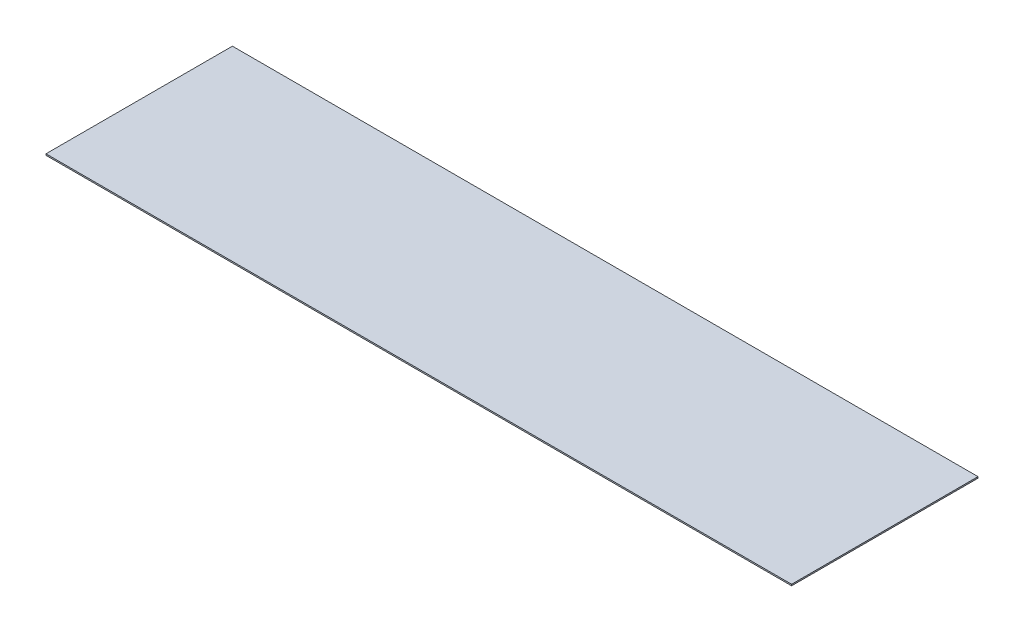
ISO-10303-21;
HEADER;
FILE_DESCRIPTION(('STEP AP214'),'2;1');
FILE_NAME('part.step','',(''),(''),'','','');
FILE_SCHEMA(('AUTOMOTIVE_DESIGN { 1 0 10303 214 1 1 1 1 }'));
ENDSEC;
DATA;
#1=APPLICATION_CONTEXT('core data for automotive mechanical design processes');
#2=APPLICATION_PROTOCOL_DEFINITION('international standard','automotive_design',2000,#1);
#3=PRODUCT_CONTEXT('',#1,'mechanical');
#4=PRODUCT('Part','Part','',(#3));
#5=PRODUCT_RELATED_PRODUCT_CATEGORY('part','',(#4));
#6=PRODUCT_DEFINITION_FORMATION('','',#4);
#7=PRODUCT_DEFINITION_CONTEXT('part definition',#1,'design');
#8=PRODUCT_DEFINITION('design','',#6,#7);
#9=PRODUCT_DEFINITION_SHAPE('','',#8);
#10=(LENGTH_UNIT() NAMED_UNIT(*) SI_UNIT(.MILLI.,.METRE.));
#11=(NAMED_UNIT(*) PLANE_ANGLE_UNIT() SI_UNIT($,.RADIAN.));
#12=(NAMED_UNIT(*) SI_UNIT($,.STERADIAN.) SOLID_ANGLE_UNIT());
#13=UNCERTAINTY_MEASURE_WITH_UNIT(LENGTH_MEASURE(1.E-05),#10,'distance_accuracy_value','');
#14=(GEOMETRIC_REPRESENTATION_CONTEXT(3) GLOBAL_UNCERTAINTY_ASSIGNED_CONTEXT((#13)) GLOBAL_UNIT_ASSIGNED_CONTEXT((#10,
#11,#12)) REPRESENTATION_CONTEXT('',''));
#15=CARTESIAN_POINT('',(0.,0.,0.));
#16=DIRECTION('',(0.,0.,1.));
#17=DIRECTION('',(1.,0.,0.));
#18=AXIS2_PLACEMENT_3D('',#15,#16,#17);
#19=CARTESIAN_POINT('',(-40.,0.15,10.));
#20=DIRECTION('',(1.,0.,0.));
#21=DIRECTION('',(0.,0.,-1.));
#22=AXIS2_PLACEMENT_3D('',#19,#20,#21);
#23=PLANE('',#22);
#24=DIRECTION('',(0.,0.,1.));
#25=VECTOR('',#24,1.);
#26=CARTESIAN_POINT('',(-40.,0.,10.));
#27=LINE('',#26,#25);
#28=CARTESIAN_POINT('',(-40.,0.,-10.));
#29=VERTEX_POINT('',#28);
#30=CARTESIAN_POINT('',(-40.,0.,10.));
#31=VERTEX_POINT('',#30);
#32=EDGE_CURVE('E96',#29,#31,#27,.T.);
#33=ORIENTED_EDGE('',*,*,#32,.T.);
#34=DIRECTION('',(0.,-1.,0.));
#35=VECTOR('',#34,1.);
#36=CARTESIAN_POINT('',(-40.,0.15,10.));
#37=LINE('',#36,#35);
#38=CARTESIAN_POINT('',(-40.,0.15,10.));
#39=VERTEX_POINT('',#38);
#40=EDGE_CURVE('E11',#39,#31,#37,.T.);
#41=ORIENTED_EDGE('',*,*,#40,.F.);
#42=DIRECTION('',(0.,0.,1.));
#43=VECTOR('',#42,1.);
#44=CARTESIAN_POINT('',(-40.,0.15,10.));
#45=LINE('',#44,#43);
#46=CARTESIAN_POINT('',(-40.,0.15,-10.));
#47=VERTEX_POINT('',#46);
#48=EDGE_CURVE('E84',#47,#39,#45,.T.);
#49=ORIENTED_EDGE('',*,*,#48,.F.);
#50=DIRECTION('',(0.,-1.,0.));
#51=VECTOR('',#50,1.);
#52=CARTESIAN_POINT('',(-40.,0.15,-10.));
#53=LINE('',#52,#51);
#54=EDGE_CURVE('E92',#47,#29,#53,.T.);
#55=ORIENTED_EDGE('',*,*,#54,.T.);
#56=EDGE_LOOP('',(#33,#41,#49,#55));
#57=FACE_BOUND('',#56,.T.);
#58=ADVANCED_FACE('F33',(#57),#23,.F.);
#59=CARTESIAN_POINT('',(40.,0.15,10.));
#60=DIRECTION('',(0.,0.,-1.));
#61=DIRECTION('',(-1.,0.,0.));
#62=AXIS2_PLACEMENT_3D('',#59,#60,#61);
#63=PLANE('',#62);
#64=DIRECTION('',(1.,0.,0.));
#65=VECTOR('',#64,1.);
#66=CARTESIAN_POINT('',(40.,0.,10.));
#67=LINE('',#66,#65);
#68=CARTESIAN_POINT('',(40.,0.,10.));
#69=VERTEX_POINT('',#68);
#70=EDGE_CURVE('E88',#31,#69,#67,.T.);
#71=ORIENTED_EDGE('',*,*,#70,.T.);
#72=DIRECTION('',(0.,-1.,0.));
#73=VECTOR('',#72,1.);
#74=CARTESIAN_POINT('',(40.,0.15,10.));
#75=LINE('',#74,#73);
#76=CARTESIAN_POINT('',(40.,0.15,10.));
#77=VERTEX_POINT('',#76);
#78=EDGE_CURVE('E41',#77,#69,#75,.T.);
#79=ORIENTED_EDGE('',*,*,#78,.F.);
#80=DIRECTION('',(1.,0.,0.));
#81=VECTOR('',#80,1.);
#82=CARTESIAN_POINT('',(40.,0.15,10.));
#83=LINE('',#82,#81);
#84=EDGE_CURVE('E79',#39,#77,#83,.T.);
#85=ORIENTED_EDGE('',*,*,#84,.F.);
#86=ORIENTED_EDGE('',*,*,#40,.T.);
#87=EDGE_LOOP('',(#71,#79,#85,#86));
#88=FACE_BOUND('',#87,.T.);
#89=ADVANCED_FACE('F87',(#88),#63,.F.);
#90=CARTESIAN_POINT('',(40.,0.15,10.));
#91=DIRECTION('',(-1.,0.,0.));
#92=DIRECTION('',(0.,0.,1.));
#93=AXIS2_PLACEMENT_3D('',#90,#91,#92);
#94=PLANE('',#93);
#95=DIRECTION('',(0.,0.,-1.));
#96=VECTOR('',#95,1.);
#97=CARTESIAN_POINT('',(40.,0.,10.));
#98=LINE('',#97,#96);
#99=CARTESIAN_POINT('',(40.,0.,-10.));
#100=VERTEX_POINT('',#99);
#101=EDGE_CURVE('E66',#69,#100,#98,.T.);
#102=ORIENTED_EDGE('',*,*,#101,.T.);
#103=DIRECTION('',(0.,-1.,0.));
#104=VECTOR('',#103,1.);
#105=CARTESIAN_POINT('',(40.,0.15,-10.));
#106=LINE('',#105,#104);
#107=CARTESIAN_POINT('',(40.,0.15,-10.));
#108=VERTEX_POINT('',#107);
#109=EDGE_CURVE('E89',#108,#100,#106,.T.);
#110=ORIENTED_EDGE('',*,*,#109,.F.);
#111=DIRECTION('',(0.,0.,-1.));
#112=VECTOR('',#111,1.);
#113=CARTESIAN_POINT('',(40.,0.15,10.));
#114=LINE('',#113,#112);
#115=EDGE_CURVE('E82',#77,#108,#114,.T.);
#116=ORIENTED_EDGE('',*,*,#115,.F.);
#117=ORIENTED_EDGE('',*,*,#78,.T.);
#118=EDGE_LOOP('',(#102,#110,#116,#117));
#119=FACE_BOUND('',#118,.T.);
#120=ADVANCED_FACE('F90',(#119),#94,.F.);
#121=CARTESIAN_POINT('',(40.,0.15,-10.));
#122=DIRECTION('',(0.,0.,1.));
#123=DIRECTION('',(1.,0.,0.));
#124=AXIS2_PLACEMENT_3D('',#121,#122,#123);
#125=PLANE('',#124);
#126=DIRECTION('',(-1.,0.,0.));
#127=VECTOR('',#126,1.);
#128=CARTESIAN_POINT('',(40.,0.,-10.));
#129=LINE('',#128,#127);
#130=EDGE_CURVE('E72',#100,#29,#129,.T.);
#131=ORIENTED_EDGE('',*,*,#130,.T.);
#132=ORIENTED_EDGE('',*,*,#54,.F.);
#133=DIRECTION('',(-1.,0.,0.));
#134=VECTOR('',#133,1.);
#135=CARTESIAN_POINT('',(40.,0.15,-10.));
#136=LINE('',#135,#134);
#137=EDGE_CURVE('E49',#108,#47,#136,.T.);
#138=ORIENTED_EDGE('',*,*,#137,.F.);
#139=ORIENTED_EDGE('',*,*,#109,.T.);
#140=EDGE_LOOP('',(#131,#132,#138,#139));
#141=FACE_BOUND('',#140,.T.);
#142=ADVANCED_FACE('F103',(#141),#125,.F.);
#143=CARTESIAN_POINT('',(0.,0.15,0.));
#144=DIRECTION('',(0.,1.,0.));
#145=DIRECTION('',(0.,0.,1.));
#146=AXIS2_PLACEMENT_3D('',#143,#144,#145);
#147=PLANE('',#146);
#148=ORIENTED_EDGE('',*,*,#48,.T.);
#149=ORIENTED_EDGE('',*,*,#84,.T.);
#150=ORIENTED_EDGE('',*,*,#115,.T.);
#151=ORIENTED_EDGE('',*,*,#137,.T.);
#152=EDGE_LOOP('',(#148,#149,#150,#151));
#153=FACE_BOUND('',#152,.T.);
#154=ADVANCED_FACE('F80',(#153),#147,.T.);
#155=CARTESIAN_POINT('',(0.,0.,0.));
#156=DIRECTION('',(0.,1.,0.));
#157=DIRECTION('',(0.,0.,1.));
#158=AXIS2_PLACEMENT_3D('',#155,#156,#157);
#159=PLANE('',#158);
#160=ORIENTED_EDGE('',*,*,#32,.F.);
#161=ORIENTED_EDGE('',*,*,#130,.F.);
#162=ORIENTED_EDGE('',*,*,#101,.F.);
#163=ORIENTED_EDGE('',*,*,#70,.F.);
#164=EDGE_LOOP('',(#160,#161,#162,#163));
#165=FACE_BOUND('',#164,.T.);
#166=ADVANCED_FACE('F106',(#165),#159,.F.);
#167=CLOSED_SHELL('',(#58,#89,#120,#142,#154,#166));
#168=MANIFOLD_SOLID_BREP('B2',#167);
#169=ADVANCED_BREP_SHAPE_REPRESENTATION('',(#18,#168),#14);
#170=SHAPE_DEFINITION_REPRESENTATION(#9,#169);
ENDSEC;
END-ISO-10303-21;
